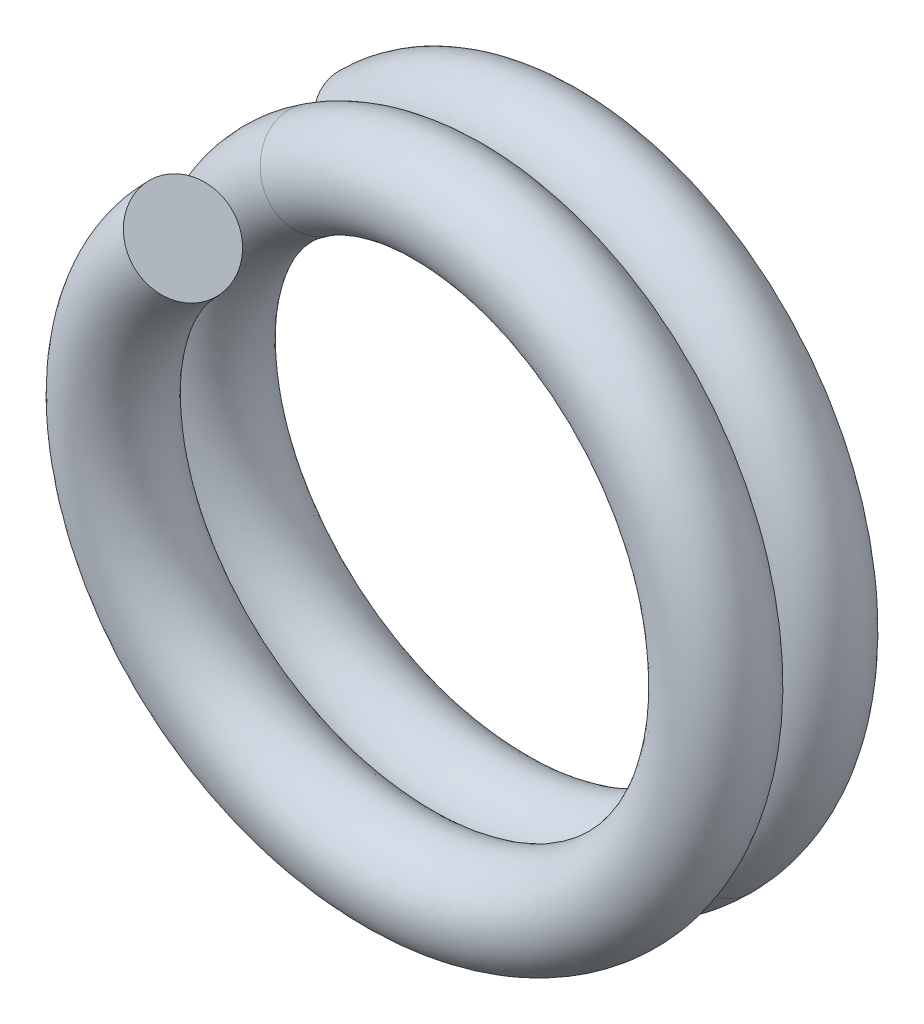
ISO-10303-21;
HEADER;
FILE_DESCRIPTION(('STEP AP214'),'2;1');
FILE_NAME('part.step','',(''),(''),'','','');
FILE_SCHEMA(('AUTOMOTIVE_DESIGN { 1 0 10303 214 1 1 1 1 }'));
ENDSEC;
DATA;
#1=APPLICATION_CONTEXT('core data for automotive mechanical design processes');
#2=APPLICATION_PROTOCOL_DEFINITION('international standard','automotive_design',2000,#1);
#3=PRODUCT_CONTEXT('',#1,'mechanical');
#4=PRODUCT('Part','Part','',(#3));
#5=PRODUCT_RELATED_PRODUCT_CATEGORY('part','',(#4));
#6=PRODUCT_DEFINITION_FORMATION('','',#4);
#7=PRODUCT_DEFINITION_CONTEXT('part definition',#1,'design');
#8=PRODUCT_DEFINITION('design','',#6,#7);
#9=PRODUCT_DEFINITION_SHAPE('','',#8);
#10=(LENGTH_UNIT() NAMED_UNIT(*) SI_UNIT(.MILLI.,.METRE.));
#11=(NAMED_UNIT(*) PLANE_ANGLE_UNIT() SI_UNIT($,.RADIAN.));
#12=(NAMED_UNIT(*) SI_UNIT($,.STERADIAN.) SOLID_ANGLE_UNIT());
#13=UNCERTAINTY_MEASURE_WITH_UNIT(LENGTH_MEASURE(1.E-05),#10,'distance_accuracy_value','');
#14=(GEOMETRIC_REPRESENTATION_CONTEXT(3) GLOBAL_UNCERTAINTY_ASSIGNED_CONTEXT((#13)) GLOBAL_UNIT_ASSIGNED_CONTEXT((#10,
#11,#12)) REPRESENTATION_CONTEXT('',''));
#15=CARTESIAN_POINT('',(0.,0.,0.));
#16=DIRECTION('',(0.,0.,1.));
#17=DIRECTION('',(1.,0.,0.));
#18=AXIS2_PLACEMENT_3D('',#15,#16,#17);
#19=CARTESIAN_POINT('',(7.2478445073792,-7.24784450694502,1.4999999999857));
#20=CARTESIAN_POINT('',(6.2991038813887,-8.19658513302185,1.56249999998574));
#21=CARTESIAN_POINT('',(5.1620945472785,-8.95631048126188,1.62499999998566));
#22=CARTESIAN_POINT('',(2.68291581648946,-9.98321993510202,1.75000000000004));
#23=CARTESIAN_POINT('',(1.3417218605146,-10.2499999999988,1.81250000000026));
#24=CARTESIAN_POINT('',(-1.34172186051466,-10.2500000000012,1.93749999999974));
#25=CARTESIAN_POINT('',(-2.68291581648708,-9.98321993510321,1.99999999999965));
#26=CARTESIAN_POINT('',(-5.16209454699733,-8.95631048137814,2.12500000000034));
#27=CARTESIAN_POINT('',(-6.29910388112856,-8.19658513319566,2.18749999999996));
#28=CARTESIAN_POINT('',(-8.19658513319572,-6.2991038811285,2.31250000000004));
#29=CARTESIAN_POINT('',(-8.9563104813806,-5.16209454699178,2.37499999999996));
#30=CARTESIAN_POINT('',(-9.98321993510082,-2.68291581649246,2.50000000000004));
#31=CARTESIAN_POINT('',(-10.2500000000024,-1.34172186051821,2.56249999999996));
#32=CARTESIAN_POINT('',(-10.2499999999976,1.34172186051833,2.68750000000004));
#33=CARTESIAN_POINT('',(-9.98321993509956,2.68291581649319,2.74999999999996));
#34=CARTESIAN_POINT('',(-8.95631048138176,5.16209454699129,2.87500000000004));
#35=CARTESIAN_POINT('',(-8.19658513320181,6.29910388112242,2.93750000000018));
#36=CARTESIAN_POINT('',(-6.77991612433642,7.7157728899878,3.03082562622893));
#37=CARTESIAN_POINT('',(-6.26619022540514,8.1377221490392,3.06165125245793));
#38=CARTESIAN_POINT('',(-5.7169474257057,8.50682299676349,3.09247687868696));
#39=CARTESIAN_POINT('',(7.36342751011872,-7.13226150419858,4.4955435464817));
#40=CARTESIAN_POINT('',(6.42981666378565,-8.09613190993147,4.55804354648189));
#41=CARTESIAN_POINT('',(5.30492284028362,-8.87398940116307,4.6205435464815));
#42=CARTESIAN_POINT('',(2.84212046498882,-9.94043487454094,4.74554354649619));
#43=CARTESIAN_POINT('',(1.50518091057382,-10.2286032604115,4.80804354649672));
#44=CARTESIAN_POINT('',(-1.17826281045603,-10.2713967395885,4.93304354649528));
#45=CARTESIAN_POINT('',(-2.52371116798757,-10.0260049956637,4.9955435464955));
#46=CARTESIAN_POINT('',(-5.01926625399049,-9.03863156147304,5.12054354649649));
#47=CARTESIAN_POINT('',(-6.16839109872854,-8.29703835628159,5.18304354649581));
#48=CARTESIAN_POINT('',(-8.09613191010979,-6.42981666352853,5.30804354649619));
#49=CARTESIAN_POINT('',(-8.87398940128571,-5.30492283999923,5.37054354649581));
#50=CARTESIAN_POINT('',(-9.94043487454035,-2.84212046499136,5.49554354649619));
#51=CARTESIAN_POINT('',(-10.2286032604158,-1.50518091057713,5.55804354649611));
#52=CARTESIAN_POINT('',(-10.2713967395842,1.17826281045941,5.68304354649589));
#53=CARTESIAN_POINT('',(-10.0260049956612,2.52371116799352,5.74554354649611));
#54=CARTESIAN_POINT('',(-9.03863156147545,5.0192662539846,5.87054354649589));
#55=CARTESIAN_POINT('',(-8.29703835628779,6.16839109872245,5.93304354649634));
#56=CARTESIAN_POINT('',(-6.90296128600154,7.60765204616697,6.02636917272486));
#57=CARTESIAN_POINT('',(-6.39596430658797,8.03779380740653,6.05719479895389));
#58=CARTESIAN_POINT('',(-5.85260764093189,8.41565355330545,6.08802042518296));
#59=CARTESIAN_POINT('',(5.24210716649553,-5.01094116070248,4.4955435464817));
#60=CARTESIAN_POINT('',(4.58617650337928,-5.69713138319389,4.55804354648189));
#61=CARTESIAN_POINT('',(3.79406589961683,-6.2526302359151,4.62054354648181));
#62=CARTESIAN_POINT('',(2.05687681138205,-7.01851684475557,4.74554354649589));
#63=CARTESIAN_POINT('',(1.11248182944733,-7.22860326041213,4.80804354649641));
#64=CARTESIAN_POINT('',(-0.785563729329528,-7.27139673958787,4.93304354649559));
#65=CARTESIAN_POINT('',(-1.73846751438155,-7.10408696587832,4.9955435464952));
#66=CARTESIAN_POINT('',(-3.50840931340595,-6.41727239619069,5.1205435464968));
#67=CARTESIAN_POINT('',(-4.32475093839831,-5.89803782949314,5.18304354649611));
#68=CARTESIAN_POINT('',(-5.69713138332072,-4.58617650319771,5.30804354649589));
#69=CARTESIAN_POINT('',(-6.25263023600456,-3.79406589941562,5.37054354649611));
#70=CARTESIAN_POINT('',(-7.01851684475376,-2.05687681138446,5.49554354649589));
#71=CARTESIAN_POINT('',(-7.22860326041365,-1.11248182944959,5.55804354649581));
#72=CARTESIAN_POINT('',(-7.27139673958635,0.785563729331826,5.68304354649619));
#73=CARTESIAN_POINT('',(-7.10408696587619,1.73846751438628,5.74554354649581));
#74=CARTESIAN_POINT('',(-6.4172723961928,3.50840931340127,5.87054354649619));
#75=CARTESIAN_POINT('',(-5.89803782949705,4.32475093839391,5.93304354649603));
#76=CARTESIAN_POINT('',(-4.9185955910738,5.34937705397544,6.02636917272501));
#77=CARTESIAN_POINT('',(-4.56195741134771,5.65602147110259,6.05719479895396));
#78=CARTESIAN_POINT('',(-4.17935473584772,5.9258517005945,6.08802042518296));
#79=CARTESIAN_POINT('',(5.12652416375602,-5.12652416344892,1.4999999999857));
#80=CARTESIAN_POINT('',(4.45546372098203,-5.79758460628397,1.56249999998574));
#81=CARTESIAN_POINT('',(3.65123760661186,-6.33495131601422,1.62499999998566));
#82=CARTESIAN_POINT('',(1.89767216288254,-7.06130190531634,1.75000000000004));
#83=CARTESIAN_POINT('',(0.949022779388409,-7.24999999999878,1.81250000000026));
#84=CARTESIAN_POINT('',(-0.949022779388453,-7.25000000000121,1.93749999999974));
#85=CARTESIAN_POINT('',(-1.89767216288106,-7.06130190531693,1.99999999999965));
#86=CARTESIAN_POINT('',(-3.65123760641279,-6.3349513160967,2.12500000000034));
#87=CARTESIAN_POINT('',(-4.45546372079803,-5.79758460640691,2.18749999999996));
#88=CARTESIAN_POINT('',(-5.79758460640695,-4.45546372079799,2.31250000000004));
#89=CARTESIAN_POINT('',(-6.33495131609915,-3.65123760640878,2.37499999999996));
#90=CARTESIAN_POINT('',(-7.06130190531453,-1.89767216288495,2.50000000000004));
#91=CARTESIAN_POINT('',(-7.25000000000061,-0.949022779390511,2.56249999999996));
#92=CARTESIAN_POINT('',(-7.24999999999939,0.949022779390599,2.68750000000004));
#93=CARTESIAN_POINT('',(-7.0613019053145,1.89767216288564,2.74999999999996));
#94=CARTESIAN_POINT('',(-6.33495131609912,3.65123760640826,2.87500000000004));
#95=CARTESIAN_POINT('',(-5.79758460641106,4.45546372079387,2.93750000000019));
#96=CARTESIAN_POINT('',(-4.79555042940867,5.45749789779627,3.03082562622893));
#97=CARTESIAN_POINT('',(-4.43218333016477,5.75594981273511,3.06165125245793));
#98=CARTESIAN_POINT('',(-4.04369452062137,6.01702114405231,3.09247687868696));
#99=CARTESIAN_POINT('',(5.0109411610165,-5.24210716619536,-1.4955435465103));
#100=CARTESIAN_POINT('',(4.32475093858478,-5.89803782937405,-1.43304354651041));
#101=CARTESIAN_POINT('',(3.50840931360689,-6.41727239611334,-1.37054354651049));
#102=CARTESIAN_POINT('',(1.73846751438303,-7.10408696587712,-1.24554354649581));
#103=CARTESIAN_POINT('',(0.785563729329485,-7.27139673958544,-1.18304354649589));
#104=CARTESIAN_POINT('',(-1.11248182944738,-7.22860326041456,-1.05804354649611));
#105=CARTESIAN_POINT('',(-2.05687681138058,-7.01851684475555,-0.995543546495889));
#106=CARTESIAN_POINT('',(-3.79406589941963,-6.25263023600271,-0.870543546496111));
#107=CARTESIAN_POINT('',(-4.58617650319775,-5.69713138332067,-0.808043546496193));
#108=CARTESIAN_POINT('',(-5.89803782949318,-4.32475093839826,-0.683043546495807));
#109=CARTESIAN_POINT('',(-6.41727239619375,-3.50840931340194,-0.620543546496193));
#110=CARTESIAN_POINT('',(-7.10408696587531,-1.73846751438543,-0.495543546495807));
#111=CARTESIAN_POINT('',(-7.27139673958756,-0.785563729331434,-0.43304354649589));
#112=CARTESIAN_POINT('',(-7.22860326041244,1.11248182944937,-0.30804354649611));
#113=CARTESIAN_POINT('',(-7.01851684475281,2.056876811385,-0.24554354649589));
#114=CARTESIAN_POINT('',(-6.25263023600543,3.79406589941526,-0.120543546496111));
#115=CARTESIAN_POINT('',(-5.69713138332508,4.58617650319384,-0.0580435464956631));
#116=CARTESIAN_POINT('',(-4.67250526774355,5.5656187416171,0.0352820797328591));
#117=CARTESIAN_POINT('',(-4.30240924898184,5.85587815436763,0.0661077059618862));
#118=CARTESIAN_POINT('',(-3.90803430539501,6.10819058751012,0.0969333321909604));
#119=CARTESIAN_POINT('',(7.13226150463969,-7.36342750969146,-1.4955435465103));
#120=CARTESIAN_POINT('',(6.16839109899175,-8.29703835611224,-1.43304354651041));
#121=CARTESIAN_POINT('',(5.01926625427338,-9.03863156136069,-1.37054354651019));
#122=CARTESIAN_POINT('',(2.52371116799009,-10.0260049956631,-1.24554354649611));
#123=CARTESIAN_POINT('',(1.17826281045537,-10.271396739586,-1.18304354649619));
#124=CARTESIAN_POINT('',(-1.50518091057328,-10.228603260414,-1.05804354649581));
#125=CARTESIAN_POINT('',(-2.8421204649866,-9.94043487454273,-0.995543546496193));
#126=CARTESIAN_POINT('',(-5.30492284000417,-8.87398940128324,-0.870543546495807));
#127=CARTESIAN_POINT('',(-6.42981666352859,-8.09613191010973,-0.808043546495889));
#128=CARTESIAN_POINT('',(-8.29703835628165,-6.16839109872848,-0.68304354649611));
#129=CARTESIAN_POINT('',(-9.0386315614755,-5.01926625398433,-0.62054354649589));
#130=CARTESIAN_POINT('',(-10.0260049956613,-2.52371116799355,-0.495543546496111));
#131=CARTESIAN_POINT('',(-10.2713967395891,-1.17826281045928,-0.433043546496193));
#132=CARTESIAN_POINT('',(-10.2286032604109,1.50518091057726,-0.308043546495807));
#133=CARTESIAN_POINT('',(-9.94043487453786,2.84212046499285,-0.245543546496193));
#134=CARTESIAN_POINT('',(-8.87398940128808,5.30492283999799,-0.120543546495807));
#135=CARTESIAN_POINT('',(-8.09613191011582,6.42981666352239,-0.0580435464959666));
#136=CARTESIAN_POINT('',(-6.6568709626713,7.82389373380863,0.0352820797330088));
#137=CARTESIAN_POINT('',(-6.13641614422231,8.23765049067186,0.0661077059619641));
#138=CARTESIAN_POINT('',(-5.58128721047952,8.59799244022152,0.0969333321909635));
#139=CARTESIAN_POINT('',(7.2478445073792,-7.24784450694502,1.4999999999857));
#140=CARTESIAN_POINT('',(6.2991038813887,-8.19658513302185,1.56249999998574));
#141=CARTESIAN_POINT('',(5.1620945472785,-8.95631048126188,1.62499999998566));
#142=CARTESIAN_POINT('',(2.68291581648946,-9.98321993510202,1.75000000000004));
#143=CARTESIAN_POINT('',(1.3417218605146,-10.2499999999988,1.81250000000026));
#144=CARTESIAN_POINT('',(-1.34172186051466,-10.2500000000012,1.93749999999974));
#145=CARTESIAN_POINT('',(-2.68291581648708,-9.98321993510321,1.99999999999965));
#146=CARTESIAN_POINT('',(-5.16209454699733,-8.95631048137814,2.12500000000034));
#147=CARTESIAN_POINT('',(-6.29910388112856,-8.19658513319566,2.18749999999996));
#148=CARTESIAN_POINT('',(-8.19658513319572,-6.2991038811285,2.31250000000004));
#149=CARTESIAN_POINT('',(-8.9563104813806,-5.16209454699178,2.37499999999996));
#150=CARTESIAN_POINT('',(-9.98321993510082,-2.68291581649246,2.50000000000004));
#151=CARTESIAN_POINT('',(-10.2500000000024,-1.34172186051821,2.56249999999996));
#152=CARTESIAN_POINT('',(-10.2499999999976,1.34172186051833,2.68750000000004));
#153=CARTESIAN_POINT('',(-9.98321993509956,2.68291581649319,2.74999999999996));
#154=CARTESIAN_POINT('',(-8.95631048138176,5.16209454699129,2.87500000000004));
#155=CARTESIAN_POINT('',(-8.19658513320181,6.29910388112242,2.93750000000018));
#156=CARTESIAN_POINT('',(-6.77991612433642,7.7157728899878,3.03082562622893));
#157=CARTESIAN_POINT('',(-6.26619022540514,8.1377221490392,3.06165125245793));
#158=CARTESIAN_POINT('',(-5.7169474257057,8.50682299676349,3.09247687868696));
#159=(BOUNDED_SURFACE() B_SPLINE_SURFACE(3,3,((#19,#20,#21,#22,#23,#24,#25,#26,#27,#28,#29,#30,
#31,#32,#33,#34,#35,#36,#37,#38),(#39,#40,#41,#42,#43,#44,#45,#46,#47,#48,#49,#50,#51,#52,#53,
#54,#55,#56,#57,#58),(#59,#60,#61,#62,#63,#64,#65,#66,#67,#68,#69,#70,#71,#72,#73,#74,#75,#76,
#77,#78),(#79,#80,#81,#82,#83,#84,#85,#86,#87,#88,#89,#90,#91,#92,#93,#94,#95,#96,#97,#98),(#99,
#100,#101,#102,#103,#104,#105,#106,#107,#108,#109,#110,#111,#112,#113,#114,#115,#116,#117,#118),
(#119,#120,#121,#122,#123,#124,#125,#126,#127,#128,#129,#130,#131,#132,#133,#134,#135,#136,#137,
#138),(#139,#140,#141,#142,#143,#144,#145,#146,#147,#148,#149,#150,#151,#152,#153,#154,#155,
#156,#157,#158)),.UNSPECIFIED.,.T.,.F.,.F.) B_SPLINE_SURFACE_WITH_KNOTS((4,3,4),(4,2,2,2,2,2,2,
2,2,4),(0.,0.5,1.),(0.25,0.28125,0.3125,0.34375,0.375,0.40625,0.4375,0.46875,0.5,
0.515412813114518),
.UNSPECIFIED.) GEOMETRIC_REPRESENTATION_ITEM() RATIONAL_B_SPLINE_SURFACE(((1.,1.,1.,1.,1.,1.,1.,
1.,1.,1.,1.,1.,1.,1.,1.,1.,1.,1.,1.,1.),(0.333333333333333,0.333333333333333,0.333333333333333,
0.333333333333333,0.333333333333333,0.333333333333333,0.333333333333333,0.333333333333333,
0.333333333333333,0.333333333333333,0.333333333333333,0.333333333333333,0.333333333333333,
0.333333333333333,0.333333333333333,0.333333333333333,0.333333333333333,0.333333333333333,
0.333333333333333,0.333333333333333),(0.333333333333333,0.333333333333333,0.333333333333333,
0.333333333333333,0.333333333333333,0.333333333333333,0.333333333333333,0.333333333333333,
0.333333333333333,0.333333333333333,0.333333333333333,0.333333333333333,0.333333333333333,
0.333333333333333,0.333333333333333,0.333333333333333,0.333333333333333,0.333333333333333,
0.333333333333333,0.333333333333333),(1.,1.,1.,1.,1.,1.,1.,1.,1.,1.,1.,1.,1.,1.,1.,1.,1.,1.,1.,
1.),(0.333333333333333,0.333333333333333,0.333333333333333,0.333333333333333,0.333333333333333,
0.333333333333333,0.333333333333333,0.333333333333333,0.333333333333333,0.333333333333333,
0.333333333333333,0.333333333333333,0.333333333333333,0.333333333333333,0.333333333333333,
0.333333333333333,0.333333333333333,0.333333333333333,0.333333333333333,0.333333333333333),
(0.333333333333333,0.333333333333333,0.333333333333333,0.333333333333333,0.333333333333333,
0.333333333333333,0.333333333333333,0.333333333333333,0.333333333333333,0.333333333333333,
0.333333333333333,0.333333333333333,0.333333333333333,0.333333333333333,0.333333333333333,
0.333333333333333,0.333333333333333,0.333333333333333,0.333333333333333,0.333333333333333),(1.,
1.,1.,1.,1.,1.,1.,1.,1.,1.,1.,1.,1.,1.,1.,1.,1.,1.,1.,1.))) REPRESENTATION_ITEM('') SURFACE());
#160=CARTESIAN_POINT('',(6.18718433612359,-6.18718433464099,1.49999999994279));
#161=DIRECTION('',(-0.706056384937713,-0.706056385106902,0.0544863500196415));
#162=DIRECTION('',(0.707106781271269,-0.707106781101827,0.));
#163=AXIS2_PLACEMENT_3D('',#160,#161,#162);
#164=CIRCLE('',#163,1.5);
#165=CARTESIAN_POINT('',(7.24784450803049,-7.24784450629373,1.49999999994279));
#166=VERTEX_POINT('',#165);
#167=EDGE_CURVE('E50',#166,#166,#164,.T.);
#168=CARTESIAN_POINT('',(-5.7169474257057,8.50682299676349,3.09247687868696));
#169=CARTESIAN_POINT('',(-5.85260764093189,8.41565355330545,6.08802042518296));
#170=CARTESIAN_POINT('',(-4.17935473584772,5.9258517005945,6.08802042518296));
#171=CARTESIAN_POINT('',(-4.04369452062137,6.01702114405231,3.09247687868696));
#172=CARTESIAN_POINT('',(-3.90803430539501,6.10819058751012,0.0969333321909604));
#173=CARTESIAN_POINT('',(-5.58128721047952,8.59799244022152,0.0969333321909635));
#174=CARTESIAN_POINT('',(-5.7169474257057,8.50682299676349,3.09247687868696));
#175=(BOUNDED_CURVE() B_SPLINE_CURVE(3,(#168,#169,#170,#171,#172,#173,#174),.UNSPECIFIED.,.T.,
.F.) B_SPLINE_CURVE_WITH_KNOTS((4,3,4),(0.,0.5,1.),
.UNSPECIFIED.) CURVE() GEOMETRIC_REPRESENTATION_ITEM() RATIONAL_B_SPLINE_CURVE((1.,
0.333333333333333,0.333333333333333,1.,0.333333333333333,0.333333333333333,1.)) REPRESENTATION_ITEM(''));
#176=CARTESIAN_POINT('',(-5.7169474257057,8.50682299676349,3.09247687868696));
#177=VERTEX_POINT('',#176);
#178=EDGE_CURVE('E12',#177,#177,#175,.T.);
#179=ORIENTED_EDGE('',*,*,#167,.T.);
#180=EDGE_LOOP('',(#179));
#181=FACE_BOUND('',#180,.T.);
#182=ORIENTED_EDGE('',*,*,#178,.F.);
#183=EDGE_LOOP('',(#182));
#184=FACE_BOUND('',#183,.T.);
#185=ADVANCED_FACE('F45',(#181,#184),#159,.T.);
#186=CARTESIAN_POINT('',(-7.24784450716215,7.24784450716207,0.));
#187=CARTESIAN_POINT('',(-6.29910387697723,8.19658513734942,0.0624999999999998));
#188=CARTESIAN_POINT('',(-5.16209454699401,8.95631048138068,0.124999999999992));
#189=CARTESIAN_POINT('',(-2.68291581649041,9.98321993510066,0.250000000000008));
#190=CARTESIAN_POINT('',(-1.34172186051466,10.2499999999988,0.312500000000034));
#191=CARTESIAN_POINT('',(1.34172186051459,10.2500000000012,0.437499999999965));
#192=CARTESIAN_POINT('',(2.68291581648945,9.98321993510202,0.500000000000034));
#193=CARTESIAN_POINT('',(5.16209454699484,8.95631048137938,0.624999999999965));
#194=CARTESIAN_POINT('',(6.29910388112609,8.19658513319813,0.687500000000034));
#195=CARTESIAN_POINT('',(8.1965851331981,6.29910388112612,0.812499999999965));
#196=CARTESIAN_POINT('',(8.95631048137936,5.16209454699427,0.875000000000034));
#197=CARTESIAN_POINT('',(9.98321993510201,2.68291581649009,0.999999999999965));
#198=CARTESIAN_POINT('',(10.25,1.34172186051402,1.06250000000011));
#199=CARTESIAN_POINT('',(10.25,-1.34172186051401,1.18749999999989));
#200=CARTESIAN_POINT('',(9.9832199351008,-2.68291581648948,1.24999999999981));
#201=CARTESIAN_POINT('',(8.95631048149807,-5.16209454671122,1.37499999998589));
#202=CARTESIAN_POINT('',(8.19658513336952,-6.29910388086836,1.43749999998566));
#203=CARTESIAN_POINT('',(7.2478445073792,-7.24784450694502,1.4999999999857));
#204=CARTESIAN_POINT('',(-7.36342750990513,7.1322615044191,2.995543546496));
#205=CARTESIAN_POINT('',(-6.42981665944401,8.09613191433024,3.058043546496));
#206=CARTESIAN_POINT('',(-5.30492284000071,8.873989401287,3.12054354649599));
#207=CARTESIAN_POINT('',(-2.84212046499008,9.94043487453897,3.24554354649601));
#208=CARTESIAN_POINT('',(-1.50518091057359,10.2286032604121,3.30804354649603));
#209=CARTESIAN_POINT('',(1.17826281045566,10.2713967395879,3.43304354649596));
#210=CARTESIAN_POINT('',(2.52371116798978,10.0260049956637,3.49554354649603));
#211=CARTESIAN_POINT('',(5.01926625398814,9.03863156147306,3.62054354649596));
#212=CARTESIAN_POINT('',(6.16839109872607,8.29703835628406,3.68304354649634));
#213=CARTESIAN_POINT('',(8.09613191011217,6.42981666352615,3.80804354649566));
#214=CARTESIAN_POINT('',(8.87398940128446,5.30492284000096,3.87054354649603));
#215=CARTESIAN_POINT('',(9.94043487454153,2.84212046498976,3.99554354649596));
#216=CARTESIAN_POINT('',(10.2286032604133,1.50518091057295,4.05804354649619));
#217=CARTESIAN_POINT('',(10.2713967395867,-1.17826281045509,4.18304354649581));
#218=CARTESIAN_POINT('',(10.0260049956619,-2.52371116798981,4.24554354649558));
#219=CARTESIAN_POINT('',(9.03863156158784,-5.01926625370265,4.37054354648212));
#220=CARTESIAN_POINT('',(8.29703835645161,-6.16839109846587,4.4330435464815));
#221=CARTESIAN_POINT('',(7.36342751011872,-7.13226150419858,4.4955435464817));
#222=CARTESIAN_POINT('',(-5.24210716634547,5.01094116085946,2.995543546496));
#223=CARTESIAN_POINT('',(-4.58617650032805,5.6971313863257,3.058043546496));
#224=CARTESIAN_POINT('',(-3.79406589941716,6.25263023600462,3.12054354649599));
#225=CARTESIAN_POINT('',(-2.05687681138306,7.01851684475364,3.24554354649601));
#226=CARTESIAN_POINT('',(-1.11248182944753,7.22860326041274,3.30804354649603));
#227=CARTESIAN_POINT('',(0.785563729329631,7.27139673958726,3.43304354649597));
#228=CARTESIAN_POINT('',(1.73846751438348,7.10408696587712,3.49554354649603));
#229=CARTESIAN_POINT('',(3.50840931340393,6.41727239619192,3.62054354649597));
#230=CARTESIAN_POINT('',(4.32475093839676,5.89803782949408,3.68304354649634));
#231=CARTESIAN_POINT('',(5.6971313833222,4.58617650319683,3.80804354649566));
#232=CARTESIAN_POINT('',(6.25263023600302,3.79406589941719,3.87054354649604));
#233=CARTESIAN_POINT('',(7.01851684475525,2.05687681138299,3.99554354649597));
#234=CARTESIAN_POINT('',(7.22860326041365,1.1124818294469,4.05804354649619));
#235=CARTESIAN_POINT('',(7.27139673958635,-0.785563729329047,4.18304354649581));
#236=CARTESIAN_POINT('',(7.10408696587772,-1.73846751438335,4.24554354649558));
#237=CARTESIAN_POINT('',(6.41727239626989,-3.5084093132016,4.37054354648212));
#238=CARTESIAN_POINT('',(5.89803782961167,-4.32475093821119,4.43304354648151));
#239=CARTESIAN_POINT('',(5.24210716649553,-5.01094116070248,4.4955435464817));
#240=CARTESIAN_POINT('',(-5.1265241636025,5.12652416360244,0.));
#241=CARTESIAN_POINT('',(-4.45546371786097,5.79758460934518,0.0625));
#242=CARTESIAN_POINT('',(-3.65123760641016,6.3349513160986,0.124999999999992));
#243=CARTESIAN_POINT('',(-1.8976721628837,7.06130190531503,0.250000000000008));
#244=CARTESIAN_POINT('',(-0.949022779388457,7.24999999999939,0.312500000000035));
#245=CARTESIAN_POINT('',(0.949022779388405,7.25000000000061,0.437499999999965));
#246=CARTESIAN_POINT('',(1.89767216288314,7.06130190531574,0.500000000000035));
#247=CARTESIAN_POINT('',(3.65123760641062,6.33495131609793,0.624999999999966));
#248=CARTESIAN_POINT('',(4.45546372079678,5.79758460640815,0.687500000000035));
#249=CARTESIAN_POINT('',(5.79758460640813,4.4554637207968,0.812499999999965));
#250=CARTESIAN_POINT('',(6.33495131609732,3.65123760641065,0.875000000000035));
#251=CARTESIAN_POINT('',(7.06130190531634,1.89767216288317,0.999999999999965));
#252=CARTESIAN_POINT('',(7.25,0.949022779388131,1.06250000000011));
#253=CARTESIAN_POINT('',(7.25,-0.949022779388124,1.18749999999989));
#254=CARTESIAN_POINT('',(7.06130190531634,-1.89767216288286,1.24999999999981));
#255=CARTESIAN_POINT('',(6.33495131618042,-3.65123760621031,1.37499999998589));
#256=CARTESIAN_POINT('',(5.79758460652989,-4.45546372061399,1.43749999998566));
#257=CARTESIAN_POINT('',(5.12652416375602,-5.12652416344892,1.4999999999857));
#258=CARTESIAN_POINT('',(-5.01094116085952,5.24210716634542,-2.995543546496));
#259=CARTESIAN_POINT('',(-4.32475093539389,5.89803783236466,-2.933043546496));
#260=CARTESIAN_POINT('',(-3.50840931340316,6.41727239619259,-2.87054354649601));
#261=CARTESIAN_POINT('',(-1.73846751438434,7.10408696587642,-2.74554354649599));
#262=CARTESIAN_POINT('',(-0.785563729329381,7.27139673958605,-2.68304354649597));
#263=CARTESIAN_POINT('',(1.11248182944718,7.22860326041395,-2.55804354649603));
#264=CARTESIAN_POINT('',(2.05687681138281,7.01851684475435,-2.49554354649597));
#265=CARTESIAN_POINT('',(3.79406589941731,6.25263023600395,-2.37054354649603));
#266=CARTESIAN_POINT('',(4.58617650319681,5.69713138332222,-2.30804354649627));
#267=CARTESIAN_POINT('',(5.89803782949406,4.32475093839678,-2.18304354649573));
#268=CARTESIAN_POINT('',(6.41727239619161,3.50840931340411,-2.12054354649597));
#269=CARTESIAN_POINT('',(7.10408696587742,1.73846751438335,-1.99554354649603));
#270=CARTESIAN_POINT('',(7.27139673958635,0.785563729329357,-1.93304354649597));
#271=CARTESIAN_POINT('',(7.22860326041365,-1.1124818294472,-1.80804354649603));
#272=CARTESIAN_POINT('',(7.01851684475495,-2.05687681138237,-1.74554354649597));
#273=CARTESIAN_POINT('',(6.25263023609096,-3.79406589921903,-1.62054354651034));
#274=CARTESIAN_POINT('',(5.69713138344811,-4.58617650301678,-1.55804354651019));
#275=CARTESIAN_POINT('',(5.0109411610165,-5.24210716619536,-1.4955435465103));
#276=CARTESIAN_POINT('',(-7.13226150441917,7.36342750990505,-2.995543546496));
#277=CARTESIAN_POINT('',(-6.16839109451046,8.2970383603686,-2.933043546496));
#278=CARTESIAN_POINT('',(-5.01926625398732,9.03863156147436,-2.87054354649601));
#279=CARTESIAN_POINT('',(-2.52371116799075,10.0260049956624,-2.74554354649599));
#280=CARTESIAN_POINT('',(-1.17826281045574,10.2713967395854,-2.68304354649597));
#281=CARTESIAN_POINT('',(1.50518091057351,10.2286032604146,-2.55804354649603));
#282=CARTESIAN_POINT('',(2.84212046498911,9.94043487454033,-2.49554354649597));
#283=CARTESIAN_POINT('',(5.30492284000153,8.87398940128569,-2.37054354649603));
#284=CARTESIAN_POINT('',(6.42981666352612,8.0961319101122,-2.30804354649627));
#285=CARTESIAN_POINT('',(8.29703835628403,6.16839109872609,-2.18304354649573));
#286=CARTESIAN_POINT('',(9.03863156147426,5.01926625398758,-2.12054354649597));
#287=CARTESIAN_POINT('',(10.0260049956625,2.52371116799043,-1.99554354649603));
#288=CARTESIAN_POINT('',(10.2713967395867,1.1782628104551,-1.93304354649597));
#289=CARTESIAN_POINT('',(10.2286032604133,-1.50518091057294,-1.80804354649603));
#290=CARTESIAN_POINT('',(9.94043487453972,-2.84212046498914,-1.74554354649597));
#291=CARTESIAN_POINT('',(8.8739894014083,-5.30492283971978,-1.62054354651034));
#292=CARTESIAN_POINT('',(8.09613191028744,-6.42981666327086,-1.55804354651019));
#293=CARTESIAN_POINT('',(7.13226150463969,-7.36342750969146,-1.4955435465103));
#294=CARTESIAN_POINT('',(-7.24784450716215,7.24784450716207,0.));
#295=CARTESIAN_POINT('',(-6.29910387697723,8.19658513734942,0.0624999999999998));
#296=CARTESIAN_POINT('',(-5.16209454699401,8.95631048138068,0.124999999999992));
#297=CARTESIAN_POINT('',(-2.68291581649041,9.98321993510066,0.250000000000008));
#298=CARTESIAN_POINT('',(-1.34172186051466,10.2499999999988,0.312500000000034));
#299=CARTESIAN_POINT('',(1.34172186051459,10.2500000000012,0.437499999999965));
#300=CARTESIAN_POINT('',(2.68291581648945,9.98321993510202,0.500000000000034));
#301=CARTESIAN_POINT('',(5.16209454699484,8.95631048137938,0.624999999999965));
#302=CARTESIAN_POINT('',(6.29910388112609,8.19658513319813,0.687500000000034));
#303=CARTESIAN_POINT('',(8.1965851331981,6.29910388112612,0.812499999999965));
#304=CARTESIAN_POINT('',(8.95631048137936,5.16209454699427,0.875000000000034));
#305=CARTESIAN_POINT('',(9.98321993510201,2.68291581649009,0.999999999999965));
#306=CARTESIAN_POINT('',(10.25,1.34172186051402,1.06250000000011));
#307=CARTESIAN_POINT('',(10.25,-1.34172186051401,1.18749999999989));
#308=CARTESIAN_POINT('',(9.9832199351008,-2.68291581648948,1.24999999999981));
#309=CARTESIAN_POINT('',(8.95631048149807,-5.16209454671122,1.37499999998589));
#310=CARTESIAN_POINT('',(8.19658513336952,-6.29910388086836,1.43749999998566));
#311=CARTESIAN_POINT('',(7.2478445073792,-7.24784450694502,1.4999999999857));
#312=(BOUNDED_SURFACE() B_SPLINE_SURFACE(3,3,((#186,#187,#188,#189,#190,#191,#192,#193,#194,
#195,#196,#197,#198,#199,#200,#201,#202,#203),(#204,#205,#206,#207,#208,#209,#210,#211,#212,
#213,#214,#215,#216,#217,#218,#219,#220,#221),(#222,#223,#224,#225,#226,#227,#228,#229,#230,
#231,#232,#233,#234,#235,#236,#237,#238,#239),(#240,#241,#242,#243,#244,#245,#246,#247,#248,
#249,#250,#251,#252,#253,#254,#255,#256,#257),(#258,#259,#260,#261,#262,#263,#264,#265,#266,
#267,#268,#269,#270,#271,#272,#273,#274,#275),(#276,#277,#278,#279,#280,#281,#282,#283,#284,
#285,#286,#287,#288,#289,#290,#291,#292,#293),(#294,#295,#296,#297,#298,#299,#300,#301,#302,
#303,#304,#305,#306,#307,#308,#309,#310,#311)),.UNSPECIFIED.,.T.,.F.,
.F.) B_SPLINE_SURFACE_WITH_KNOTS((4,3,4),(4,2,2,2,2,2,2,2,4),(0.,0.5,1.),(0.,0.03125,0.0625,
0.09375,0.125,0.15625,0.1875,0.21875,0.25),
.UNSPECIFIED.) GEOMETRIC_REPRESENTATION_ITEM() RATIONAL_B_SPLINE_SURFACE(((1.,1.,1.,1.,1.,1.,1.,
1.,1.,1.,1.,1.,1.,1.,1.,1.,1.,1.),(0.333333333333333,0.333333333333333,0.333333333333333,
0.333333333333333,0.333333333333333,0.333333333333333,0.333333333333333,0.333333333333333,
0.333333333333333,0.333333333333333,0.333333333333333,0.333333333333333,0.333333333333333,
0.333333333333333,0.333333333333333,0.333333333333333,0.333333333333333,0.333333333333333),
(0.333333333333333,0.333333333333333,0.333333333333333,0.333333333333333,0.333333333333333,
0.333333333333333,0.333333333333333,0.333333333333333,0.333333333333333,0.333333333333333,
0.333333333333333,0.333333333333333,0.333333333333333,0.333333333333333,0.333333333333333,
0.333333333333333,0.333333333333333,0.333333333333333),(1.,1.,1.,1.,1.,1.,1.,1.,1.,1.,1.,1.,1.,
1.,1.,1.,1.,1.),(0.333333333333333,0.333333333333333,0.333333333333333,0.333333333333333,
0.333333333333333,0.333333333333333,0.333333333333333,0.333333333333333,0.333333333333333,
0.333333333333333,0.333333333333333,0.333333333333333,0.333333333333333,0.333333333333333,
0.333333333333333,0.333333333333333,0.333333333333333,0.333333333333333),(0.333333333333333,
0.333333333333333,0.333333333333333,0.333333333333333,0.333333333333333,0.333333333333333,
0.333333333333333,0.333333333333333,0.333333333333333,0.333333333333333,0.333333333333333,
0.333333333333333,0.333333333333333,0.333333333333333,0.333333333333333,0.333333333333333,
0.333333333333333,0.333333333333333),(1.,1.,1.,1.,1.,1.,1.,1.,1.,1.,1.,1.,1.,1.,1.,1.,1.,1.))) REPRESENTATION_ITEM('') SURFACE());
#313=CARTESIAN_POINT('',(-6.18718433538232,6.18718433538226,0.));
#314=DIRECTION('',(0.706056385022303,0.706056385022311,0.0544863500196416));
#315=DIRECTION('',(-0.707106781186551,0.707106781186544,0.));
#316=AXIS2_PLACEMENT_3D('',#313,#314,#315);
#317=CIRCLE('',#316,1.5);
#318=CARTESIAN_POINT('',(-7.24784450716215,7.24784450716207,0.));
#319=VERTEX_POINT('',#318);
#320=EDGE_CURVE('E60',#319,#319,#317,.T.);
#321=ORIENTED_EDGE('',*,*,#320,.T.);
#322=EDGE_LOOP('',(#321));
#323=FACE_BOUND('',#322,.T.);
#324=ORIENTED_EDGE('',*,*,#167,.F.);
#325=EDGE_LOOP('',(#324));
#326=FACE_BOUND('',#325,.T.);
#327=ADVANCED_FACE('F79',(#323,#326),#312,.T.);
#328=CARTESIAN_POINT('',(-6.18718433538232,6.18718433538226,0.));
#329=DIRECTION('',(0.706056385022303,0.706056385022311,0.0544863500196416));
#330=DIRECTION('',(-0.707106781186551,0.707106781186544,0.));
#331=AXIS2_PLACEMENT_3D('',#328,#329,#330);
#332=PLANE('',#331);
#333=ORIENTED_EDGE('',*,*,#320,.F.);
#334=EDGE_LOOP('',(#333));
#335=FACE_BOUND('',#334,.T.);
#336=ADVANCED_FACE('F82',(#335),#332,.F.);
#337=CARTESIAN_POINT('',(-6.18718433538216,6.18718433538242,6.));
#338=DIRECTION('',(0.706056385022322,0.706056385022293,0.0544863500196416));
#339=DIRECTION('',(-0.707106781186533,0.707106781186562,0.));
#340=AXIS2_PLACEMENT_3D('',#337,#338,#339);
#341=PLANE('',#340);
#342=CARTESIAN_POINT('',(-6.18718433538216,6.18718433538242,6.));
#343=DIRECTION('',(0.706056385022322,0.706056385022293,0.0544863500196416));
#344=DIRECTION('',(-0.707106781186533,0.707106781186562,0.));
#345=AXIS2_PLACEMENT_3D('',#342,#343,#344);
#346=CIRCLE('',#345,1.5);
#347=CARTESIAN_POINT('',(-7.24784450716196,7.24784450716226,6.));
#348=VERTEX_POINT('',#347);
#349=EDGE_CURVE('E64',#348,#348,#346,.T.);
#350=ORIENTED_EDGE('',*,*,#349,.T.);
#351=EDGE_LOOP('',(#350));
#352=FACE_BOUND('',#351,.T.);
#353=ADVANCED_FACE('F65',(#352),#341,.T.);
#354=CARTESIAN_POINT('',(-5.7169474257057,8.50682299676349,3.09247687868696));
#355=CARTESIAN_POINT('',(-5.15258186831421,8.88608660435849,3.12415125245793));
#356=CARTESIAN_POINT('',(-4.55071665178184,9.20955149731224,3.15582562622894));
#357=CARTESIAN_POINT('',(-2.68291581649075,9.98321993510064,3.25000000000018));
#358=CARTESIAN_POINT('',(-1.34172186051423,10.25,3.31250000000012));
#359=CARTESIAN_POINT('',(1.34172186051443,10.25,3.43749999999988));
#360=CARTESIAN_POINT('',(2.68291581648971,9.98321993510057,3.50000000000012));
#361=CARTESIAN_POINT('',(5.16209454699482,8.95631048138073,3.62499999999988));
#362=CARTESIAN_POINT('',(6.29910388112659,8.19658513319764,3.68750000000012));
#363=CARTESIAN_POINT('',(8.1965851331978,6.29910388112642,3.81249999999988));
#364=CARTESIAN_POINT('',(8.95631048138203,5.16209454698793,3.87499999999951));
#365=CARTESIAN_POINT('',(9.98321993509945,2.68291581649617,4.00000000000049));
#366=CARTESIAN_POINT('',(10.25,1.34172186052027,4.06250000000012));
#367=CARTESIAN_POINT('',(10.25,-1.34172186052053,4.18749999999988));
#368=CARTESIAN_POINT('',(9.9832199351042,-2.68291581648368,4.25000000000012));
#369=CARTESIAN_POINT('',(8.95631048137707,-5.16209454700092,4.37499999999988));
#370=CARTESIAN_POINT('',(8.19658513320187,-6.29910388112236,4.43750000000012));
#371=CARTESIAN_POINT('',(6.29910388112216,-8.19658513320207,4.56249999999988));
#372=CARTESIAN_POINT('',(5.16209454698852,-8.95631048138325,4.62500000000073));
#373=CARTESIAN_POINT('',(2.68291581649555,-9.98321993509824,4.74999999999927));
#374=CARTESIAN_POINT('',(1.34172186050749,-10.2500000000012,4.81250000000073));
#375=CARTESIAN_POINT('',(-1.34172186050782,-10.2499999999988,4.93749999999927));
#376=CARTESIAN_POINT('',(-2.68291581648492,-9.98321993510418,4.99999999999951));
#377=CARTESIAN_POINT('',(-5.16209454699974,-8.95631048137706,5.12500000000049));
#378=CARTESIAN_POINT('',(-6.29910388112178,-8.19658513320245,5.18750000000012));
#379=CARTESIAN_POINT('',(-8.1965851332027,-6.29910388112152,5.31249999999988));
#380=CARTESIAN_POINT('',(-8.95631048138327,-5.16209454698849,5.37500000000012));
#381=CARTESIAN_POINT('',(-9.98321993509825,-2.68291581649552,5.49999999999988));
#382=CARTESIAN_POINT('',(-10.2500000000012,-1.34172186050745,5.56250000000012));
#383=CARTESIAN_POINT('',(-10.2499999999988,1.34172186050786,5.68749999999988));
#384=CARTESIAN_POINT('',(-9.98321993510417,2.68291581648496,5.75000000000012));
#385=CARTESIAN_POINT('',(-8.95631048137705,5.16209454699977,5.87499999999988));
#386=CARTESIAN_POINT('',(-8.19658513735541,6.29910387697124,5.93749999999891));
#387=CARTESIAN_POINT('',(-7.24784450716196,7.24784450716226,6.));
#388=CARTESIAN_POINT('',(-5.85260764093189,8.41565355330545,6.08802042518296));
#389=CARTESIAN_POINT('',(-5.2942902853959,8.80391722508549,6.11969479895397));
#390=CARTESIAN_POINT('',(-4.69758343609569,9.13698019770344,6.15136917272502));
#391=CARTESIAN_POINT('',(-2.84212046499081,9.94043487454002,6.24554354649603));
#392=CARTESIAN_POINT('',(-1.50518091057316,10.2286032604135,6.30804354649612));
#393=CARTESIAN_POINT('',(1.1782628104555,10.2713967395865,6.43304354649588));
#394=CARTESIAN_POINT('',(2.52371116798996,10.0260049956618,6.49554354649612));
#395=CARTESIAN_POINT('',(5.01926625398822,9.03863156147487,6.62054354649588));
#396=CARTESIAN_POINT('',(6.16839109872668,8.29703835628368,6.68304354649627));
#397=CARTESIAN_POINT('',(8.09613191011176,6.42981666352634,6.80804354649573));
#398=CARTESIAN_POINT('',(8.87398940128728,5.30492283999483,6.87054354649551));
#399=CARTESIAN_POINT('',(9.94043487453883,2.84212046499563,6.99554354649649));
#400=CARTESIAN_POINT('',(10.2286032604135,1.50518091057919,7.05804354649612));
#401=CARTESIAN_POINT('',(10.2713967395865,-1.17826281046161,7.18304354649588));
#402=CARTESIAN_POINT('',(10.0260049956654,-2.52371116798377,7.24554354649612));
#403=CARTESIAN_POINT('',(9.03863156147122,-5.01926625399447,7.37054354649588));
#404=CARTESIAN_POINT('',(8.29703835628791,-6.16839109872245,7.43304354649612));
#405=CARTESIAN_POINT('',(6.42981666352207,-8.09613191011603,7.55804354649588));
#406=CARTESIAN_POINT('',(5.30492283999527,-8.87398940128911,7.62054354649688));
#407=CARTESIAN_POINT('',(2.84212046499515,-9.94043487453701,7.74554354649512));
#408=CARTESIAN_POINT('',(1.50518091056641,-10.2286032604141,7.80804354649688));
#409=CARTESIAN_POINT('',(-1.1782628104489,-10.2713967395859,7.93304354649512));
#410=CARTESIAN_POINT('',(-2.52371116798517,-10.0260049956648,7.99554354649551));
#411=CARTESIAN_POINT('',(-5.01926625399314,-9.03863156147181,8.12054354649649));
#412=CARTESIAN_POINT('',(-6.16839109872156,-8.29703835628819,8.18304354649642));
#413=CARTESIAN_POINT('',(-8.09613191011696,-6.42981666352174,8.30804354649557));
#414=CARTESIAN_POINT('',(-8.87398940128852,-5.30492283999509,8.37054354649642));
#415=CARTESIAN_POINT('',(-9.94043487453763,-2.84212046499527,8.49554354649557));
#416=CARTESIAN_POINT('',(-10.2286032604153,-1.50518091056668,8.55804354649642));
#417=CARTESIAN_POINT('',(-10.2713967395847,1.17826281044924,8.68304354649557));
#418=CARTESIAN_POINT('',(-10.0260049956654,2.52371116798535,8.74554354649642));
#419=CARTESIAN_POINT('',(-9.03863156147119,5.01926625399302,8.87054354649557));
#420=CARTESIAN_POINT('',(-8.29703836037469,6.16839109450458,8.93304354649521));
#421=CARTESIAN_POINT('',(-7.36342750990494,7.13226150441929,8.995543546496));
#422=CARTESIAN_POINT('',(-4.17935473584772,5.9258517005945,6.08802042518296));
#423=CARTESIAN_POINT('',(-3.78621754345086,6.20311138966391,6.11969479895389));
#424=CARTESIAN_POINT('',(-3.3656663672821,6.44150171068564,6.15136917272487));
#425=CARTESIAN_POINT('',(-2.05687681138257,7.01851684475364,6.24554354649633));
#426=CARTESIAN_POINT('',(-1.11248182944673,7.22860326041381,6.30804354649612));
#427=CARTESIAN_POINT('',(0.785563729329022,7.27139673958619,6.43304354649588));
#428=CARTESIAN_POINT('',(1.73846751438334,7.10408696587665,6.49554354649612));
#429=CARTESIAN_POINT('',(3.50840931340424,6.41727239619232,6.62054354649588));
#430=CARTESIAN_POINT('',(4.32475093839709,5.89803782949398,6.68304354649658));
#431=CARTESIAN_POINT('',(5.69713138332201,4.5861765031968,6.80804354649542));
#432=CARTESIAN_POINT('',(6.25263023600531,3.79406589941274,6.87054354649552));
#433=CARTESIAN_POINT('',(7.01851684475304,2.05687681138725,6.99554354649649));
#434=CARTESIAN_POINT('',(7.22860326041381,1.11248182945126,7.05804354649612));
#435=CARTESIAN_POINT('',(7.27139673958619,-0.785563729333599,7.18304354649588));
#436=CARTESIAN_POINT('',(7.10408696587907,-1.73846751437987,7.24554354649612));
#437=CARTESIAN_POINT('',(6.41727239618989,-3.50840931340776,7.37054354649588));
#438=CARTESIAN_POINT('',(5.89803782949761,-4.32475093839346,7.43304354649612));
#439=CARTESIAN_POINT('',(4.58617650319314,-5.69713138332567,7.55804354649588));
#440=CARTESIAN_POINT('',(3.79406589941349,-6.25263023600623,7.62054354649718));
#441=CARTESIAN_POINT('',(2.05687681138648,-7.01851684475214,7.74554354649482));
#442=CARTESIAN_POINT('',(1.11248182944228,-7.22860326041381,7.80804354649688));
#443=CARTESIAN_POINT('',(-0.785563729324673,-7.27139673958619,7.93304354649512));
#444=CARTESIAN_POINT('',(-1.73846751438035,-7.10408696587785,7.99554354649551));
#445=CARTESIAN_POINT('',(-3.50840931340732,-6.41727239619109,8.12054354649649));
#446=CARTESIAN_POINT('',(-4.32475093839378,-5.89803782949668,8.18304354649582));
#447=CARTESIAN_POINT('',(-5.69713138332538,-4.58617650319404,8.30804354649618));
#448=CARTESIAN_POINT('',(-6.25263023600654,-3.79406589941301,8.37054354649582));
#449=CARTESIAN_POINT('',(-7.01851684475185,-2.05687681138691,8.49554354649618));
#450=CARTESIAN_POINT('',(-7.22860326041381,-1.11248182944195,8.55804354649582));
#451=CARTESIAN_POINT('',(-7.27139673958619,0.785563729324395,8.68304354649618));
#452=CARTESIAN_POINT('',(-7.10408696587845,1.73846751437992,8.74554354649582));
#453=CARTESIAN_POINT('',(-6.41727239619048,3.5084093134078,8.87054354649618));
#454=CARTESIAN_POINT('',(-5.8980378323688,4.32475093539058,8.93304354649703));
#455=CARTESIAN_POINT('',(-5.24210716634534,5.0109411608596,8.995543546496));
#456=CARTESIAN_POINT('',(-4.04369452062137,6.01702114405231,3.09247687868696));
#457=CARTESIAN_POINT('',(-3.64450912636895,6.28528076893661,3.12415125245793));
#458=CARTESIAN_POINT('',(-3.21879958296801,6.51407301029414,3.15582562622894));
#459=CARTESIAN_POINT('',(-1.89767216288297,7.06130190531487,3.25000000000018));
#460=CARTESIAN_POINT('',(-0.94902277938796,7.25,3.31250000000012));
#461=CARTESIAN_POINT('',(0.949022779388099,7.25,3.43749999999988));
#462=CARTESIAN_POINT('',(1.89767216288309,7.06130190531542,3.50000000000012));
#463=CARTESIAN_POINT('',(3.65123760641084,6.33495131609818,3.62499999999988));
#464=CARTESIAN_POINT('',(4.455463720797,5.79758460640794,3.68750000000012));
#465=CARTESIAN_POINT('',(5.79758460640805,4.45546372079689,3.81249999999988));
#466=CARTESIAN_POINT('',(6.33495131609945,3.65123760640614,3.87499999999951));
#467=CARTESIAN_POINT('',(7.06130190531427,1.89767216288749,4.00000000000049));
#468=CARTESIAN_POINT('',(7.25000000000061,0.949022779392487,4.06250000000012));
#469=CARTESIAN_POINT('',(7.24999999999939,-0.949022779392676,4.18749999999988));
#470=CARTESIAN_POINT('',(7.06130190531784,-1.89767216287947,4.25000000000012));
#471=CARTESIAN_POINT('',(6.33495131609574,-3.65123760641451,4.37499999999988));
#472=CARTESIAN_POINT('',(5.79758460641156,-4.45546372079337,4.43750000000012));
#473=CARTESIAN_POINT('',(4.45546372079323,-5.79758460641171,4.56249999999988));
#474=CARTESIAN_POINT('',(3.65123760640674,-6.33495131610067,4.62500000000073));
#475=CARTESIAN_POINT('',(1.89767216288687,-7.06130190531306,4.74999999999927));
#476=CARTESIAN_POINT('',(0.949022779383358,-7.25000000000061,4.81250000000073));
#477=CARTESIAN_POINT('',(-0.949022779383598,-7.24999999999939,4.93749999999927));
#478=CARTESIAN_POINT('',(-1.8976721628798,-7.06130190531662,4.99999999999951));
#479=CARTESIAN_POINT('',(-3.65123760641423,-6.33495131609695,5.12500000000049));
#480=CARTESIAN_POINT('',(-4.455463720794,-5.79758460641094,5.18750000000012));
#481=CARTESIAN_POINT('',(-5.79758460641112,-4.45546372079382,5.31249999999988));
#482=CARTESIAN_POINT('',(-6.33495131610008,-3.65123760640641,5.37500000000012));
#483=CARTESIAN_POINT('',(-7.06130190531368,-1.89767216288715,5.49999999999988));
#484=CARTESIAN_POINT('',(-7.25,-0.949022779383029,5.56250000000012));
#485=CARTESIAN_POINT('',(-7.25,0.94902277938332,5.68749999999988));
#486=CARTESIAN_POINT('',(-7.06130190531782,1.89767216287952,5.75000000000012));
#487=CARTESIAN_POINT('',(-6.33495131609572,3.65123760641455,5.87499999999988));
#488=CARTESIAN_POINT('',(-5.7975846093489,4.45546371785725,5.93749999999891));
#489=CARTESIAN_POINT('',(-5.12652416360236,5.12652416360258,6.));
#490=CARTESIAN_POINT('',(-3.90803430539501,6.10819058751012,0.0969333321909604));
#491=CARTESIAN_POINT('',(-3.50280070928704,6.36745014820931,0.128607705961965));
#492=CARTESIAN_POINT('',(-3.07193279865393,6.58664430990264,0.16028207973302));
#493=CARTESIAN_POINT('',(-1.73846751438337,7.10408696587609,0.25445645350403));
#494=CARTESIAN_POINT('',(-0.785563729329187,7.27139673958619,0.316956453504121));
#495=CARTESIAN_POINT('',(1.11248182944717,7.22860326041381,0.441956453503878));
#496=CARTESIAN_POINT('',(2.05687681138285,7.01851684475419,0.504456453504121));
#497=CARTESIAN_POINT('',(3.79406589941744,6.25263023600403,0.629456453503879));
#498=CARTESIAN_POINT('',(4.58617650319691,5.69713138332189,0.691956453503666));
#499=CARTESIAN_POINT('',(5.89803782949409,4.32475093839697,0.816956453504333));
#500=CARTESIAN_POINT('',(6.4172723961936,3.50840931339954,0.879456453503514));
#501=CARTESIAN_POINT('',(7.1040869658755,1.73846751438774,1.00445645350449));
#502=CARTESIAN_POINT('',(7.2713967395874,0.785563729333714,1.06695645350412));
#503=CARTESIAN_POINT('',(7.22860326041259,-1.11248182945175,1.19195645350388));
#504=CARTESIAN_POINT('',(7.01851684475661,-2.05687681137908,1.25445645350412));
#505=CARTESIAN_POINT('',(6.2526302360016,-3.79406589942126,1.37945645350388));
#506=CARTESIAN_POINT('',(5.69713138332552,-4.58617650319328,1.44195645350412));
#507=CARTESIAN_POINT('',(4.32475093839332,-5.89803782949775,1.56695645350388));
#508=CARTESIAN_POINT('',(3.50840931339998,-6.41727239619512,1.62945645350427));
#509=CARTESIAN_POINT('',(1.73846751438727,-7.10408696587399,1.75445645350373));
#510=CARTESIAN_POINT('',(0.785563729324433,-7.2713967395874,1.81695645350458));
#511=CARTESIAN_POINT('',(-1.11248182944252,-7.22860326041259,1.94195645350342));
#512=CARTESIAN_POINT('',(-2.05687681137925,-7.01851684475539,2.00445645350351));
#513=CARTESIAN_POINT('',(-3.79406589942113,-6.2526302360028,2.12945645350449));
#514=CARTESIAN_POINT('',(-4.58617650319421,-5.6971313833252,2.19195645350442));
#515=CARTESIAN_POINT('',(-5.89803782949685,-4.3247509383936,2.31695645350358));
#516=CARTESIAN_POINT('',(-6.41727239619361,-3.50840931339981,2.37945645350443));
#517=CARTESIAN_POINT('',(-7.10408696587551,-1.7384675143874,2.50445645350358));
#518=CARTESIAN_POINT('',(-7.27139673958619,-0.785563729324104,2.56695645350442));
#519=CARTESIAN_POINT('',(-7.22860326041381,1.11248182944224,2.69195645350357));
#520=CARTESIAN_POINT('',(-7.0185168447572,2.05687681137912,2.75445645350442));
#521=CARTESIAN_POINT('',(-6.25263023600097,3.79406589942131,2.87945645350357));
#522=CARTESIAN_POINT('',(-5.69713138632901,4.58617650032392,2.94195645350078));
#523=CARTESIAN_POINT('',(-5.01094116085938,5.24210716634555,3.004456453504));
#524=CARTESIAN_POINT('',(-5.58128721047952,8.59799244022152,0.0969333321909635));
#525=CARTESIAN_POINT('',(-5.01087345123253,8.96825598363149,0.128607705961892));
#526=CARTESIAN_POINT('',(-4.40384986746798,9.28212279692105,0.160282079732866));
#527=CARTESIAN_POINT('',(-2.52371116799069,10.0260049956613,0.254456453504334));
#528=CARTESIAN_POINT('',(-1.17826281045531,10.2713967395865,0.316956453504121));
#529=CARTESIAN_POINT('',(1.50518091057335,10.2286032604135,0.441956453503878));
#530=CARTESIAN_POINT('',(2.84212046498947,9.94043487453934,0.504456453504121));
#531=CARTESIAN_POINT('',(5.30492284000142,8.87398940128658,0.629456453503879));
#532=CARTESIAN_POINT('',(6.4298166635265,8.09613191011159,0.691956453503969));
#533=CARTESIAN_POINT('',(8.29703835628384,6.16839109872651,0.81695645350403));
#534=CARTESIAN_POINT('',(9.03863156147678,5.01926625398102,0.879456453503514));
#535=CARTESIAN_POINT('',(10.0260049956601,2.52371116799672,1.00445645350449));
#536=CARTESIAN_POINT('',(10.2713967395865,1.17826281046134,1.06695645350412));
#537=CARTESIAN_POINT('',(10.2286032604135,-1.50518091057946,1.19195645350388));
#538=CARTESIAN_POINT('',(9.94043487454297,-2.84212046498358,1.25445645350412));
#539=CARTESIAN_POINT('',(8.87398940128293,-5.30492284000737,1.37945645350388));
#540=CARTESIAN_POINT('',(8.09613191011582,-6.42981666352227,1.44195645350412));
#541=CARTESIAN_POINT('',(6.16839109872224,-8.29703835628811,1.56695645350388));
#542=CARTESIAN_POINT('',(5.01926625398176,-9.03863156147739,1.62945645350458));
#543=CARTESIAN_POINT('',(2.52371116799595,-10.0260049956595,1.75445645350342));
#544=CARTESIAN_POINT('',(1.17826281044856,-10.2713967395883,1.81695645350458));
#545=CARTESIAN_POINT('',(-1.50518091056675,-10.2286032604117,1.94195645350342));
#546=CARTESIAN_POINT('',(-2.84212046498468,-9.94043487454356,2.00445645350351));
#547=CARTESIAN_POINT('',(-5.30492284000634,-8.87398940128231,2.12945645350449));
#548=CARTESIAN_POINT('',(-6.42981666352199,-8.09613191011671,2.19195645350382));
#549=CARTESIAN_POINT('',(-8.29703835628843,-6.16839109872131,2.31695645350418));
#550=CARTESIAN_POINT('',(-9.03863156147801,-5.01926625398188,2.37945645350382));
#551=CARTESIAN_POINT('',(-10.0260049956589,-2.52371116799576,2.50445645350418));
#552=CARTESIAN_POINT('',(-10.2713967395871,-1.17826281044822,2.56695645350382));
#553=CARTESIAN_POINT('',(-10.2286032604129,1.50518091056648,2.69195645350418));
#554=CARTESIAN_POINT('',(-9.94043487454294,2.84212046498456,2.75445645350382));
#555=CARTESIAN_POINT('',(-8.8739894012829,5.30492284000652,2.87945645350418));
#556=CARTESIAN_POINT('',(-8.09613191433612,6.42981665943791,2.9419564535026));
#557=CARTESIAN_POINT('',(-7.13226150441898,7.36342750990524,3.004456453504));
#558=CARTESIAN_POINT('',(-5.7169474257057,8.50682299676349,3.09247687868696));
#559=CARTESIAN_POINT('',(-5.15258186831421,8.88608660435849,3.12415125245793));
#560=CARTESIAN_POINT('',(-4.55071665178184,9.20955149731224,3.15582562622894));
#561=CARTESIAN_POINT('',(-2.68291581649075,9.98321993510064,3.25000000000018));
#562=CARTESIAN_POINT('',(-1.34172186051423,10.25,3.31250000000012));
#563=CARTESIAN_POINT('',(1.34172186051443,10.25,3.43749999999988));
#564=CARTESIAN_POINT('',(2.68291581648971,9.98321993510057,3.50000000000012));
#565=CARTESIAN_POINT('',(5.16209454699482,8.95631048138073,3.62499999999988));
#566=CARTESIAN_POINT('',(6.29910388112659,8.19658513319764,3.68750000000012));
#567=CARTESIAN_POINT('',(8.1965851331978,6.29910388112642,3.81249999999988));
#568=CARTESIAN_POINT('',(8.95631048138203,5.16209454698793,3.87499999999951));
#569=CARTESIAN_POINT('',(9.98321993509945,2.68291581649617,4.00000000000049));
#570=CARTESIAN_POINT('',(10.25,1.34172186052027,4.06250000000012));
#571=CARTESIAN_POINT('',(10.25,-1.34172186052053,4.18749999999988));
#572=CARTESIAN_POINT('',(9.9832199351042,-2.68291581648368,4.25000000000012));
#573=CARTESIAN_POINT('',(8.95631048137707,-5.16209454700092,4.37499999999988));
#574=CARTESIAN_POINT('',(8.19658513320187,-6.29910388112236,4.43750000000012));
#575=CARTESIAN_POINT('',(6.29910388112216,-8.19658513320207,4.56249999999988));
#576=CARTESIAN_POINT('',(5.16209454698852,-8.95631048138325,4.62500000000073));
#577=CARTESIAN_POINT('',(2.68291581649555,-9.98321993509824,4.74999999999927));
#578=CARTESIAN_POINT('',(1.34172186050749,-10.2500000000012,4.81250000000073));
#579=CARTESIAN_POINT('',(-1.34172186050782,-10.2499999999988,4.93749999999927));
#580=CARTESIAN_POINT('',(-2.68291581648492,-9.98321993510418,4.99999999999951));
#581=CARTESIAN_POINT('',(-5.16209454699974,-8.95631048137706,5.12500000000049));
#582=CARTESIAN_POINT('',(-6.29910388112178,-8.19658513320245,5.18750000000012));
#583=CARTESIAN_POINT('',(-8.1965851332027,-6.29910388112152,5.31249999999988));
#584=CARTESIAN_POINT('',(-8.95631048138327,-5.16209454698849,5.37500000000012));
#585=CARTESIAN_POINT('',(-9.98321993509825,-2.68291581649552,5.49999999999988));
#586=CARTESIAN_POINT('',(-10.2500000000012,-1.34172186050745,5.56250000000012));
#587=CARTESIAN_POINT('',(-10.2499999999988,1.34172186050786,5.68749999999988));
#588=CARTESIAN_POINT('',(-9.98321993510417,2.68291581648496,5.75000000000012));
#589=CARTESIAN_POINT('',(-8.95631048137705,5.16209454699977,5.87499999999988));
#590=CARTESIAN_POINT('',(-8.19658513735541,6.29910387697124,5.93749999999891));
#591=CARTESIAN_POINT('',(-7.24784450716196,7.24784450716226,6.));
#592=(BOUNDED_SURFACE() B_SPLINE_SURFACE(3,3,((#354,#355,#356,#357,#358,#359,#360,#361,#362,
#363,#364,#365,#366,#367,#368,#369,#370,#371,#372,#373,#374,#375,#376,#377,#378,#379,#380,#381,
#382,#383,#384,#385,#386,#387),(#388,#389,#390,#391,#392,#393,#394,#395,#396,#397,#398,#399,
#400,#401,#402,#403,#404,#405,#406,#407,#408,#409,#410,#411,#412,#413,#414,#415,#416,#417,#418,
#419,#420,#421),(#422,#423,#424,#425,#426,#427,#428,#429,#430,#431,#432,#433,#434,#435,#436,
#437,#438,#439,#440,#441,#442,#443,#444,#445,#446,#447,#448,#449,#450,#451,#452,#453,#454,#455),
(#456,#457,#458,#459,#460,#461,#462,#463,#464,#465,#466,#467,#468,#469,#470,#471,#472,#473,#474,
#475,#476,#477,#478,#479,#480,#481,#482,#483,#484,#485,#486,#487,#488,#489),(#490,#491,#492,
#493,#494,#495,#496,#497,#498,#499,#500,#501,#502,#503,#504,#505,#506,#507,#508,#509,#510,#511,
#512,#513,#514,#515,#516,#517,#518,#519,#520,#521,#522,#523),(#524,#525,#526,#527,#528,#529,
#530,#531,#532,#533,#534,#535,#536,#537,#538,#539,#540,#541,#542,#543,#544,#545,#546,#547,#548,
#549,#550,#551,#552,#553,#554,#555,#556,#557),(#558,#559,#560,#561,#562,#563,#564,#565,#566,
#567,#568,#569,#570,#571,#572,#573,#574,#575,#576,#577,#578,#579,#580,#581,#582,#583,#584,#585,
#586,#587,#588,#589,#590,#591)),.UNSPECIFIED.,.T.,.F.,.F.) B_SPLINE_SURFACE_WITH_KNOTS((4,3,4),
(4,2,2,2,2,2,2,2,2,2,2,2,2,2,2,2,4),(0.,0.5,1.),(0.515412813114518,0.53125,0.5625,0.59375,0.625,
0.65625,0.6875,0.71875,0.75,0.78125,0.8125,0.84375,0.875,0.90625,0.9375,0.96875,1.),
.UNSPECIFIED.) GEOMETRIC_REPRESENTATION_ITEM() RATIONAL_B_SPLINE_SURFACE(((1.,1.,1.,1.,1.,1.,1.,
1.,1.,1.,1.,1.,1.,1.,1.,1.,1.,1.,1.,1.,1.,1.,1.,1.,1.,1.,1.,1.,1.,1.,1.,1.,1.,1.),
(0.333333333333333,0.333333333333333,0.333333333333333,0.333333333333333,0.333333333333333,
0.333333333333333,0.333333333333333,0.333333333333333,0.333333333333333,0.333333333333333,
0.333333333333333,0.333333333333333,0.333333333333333,0.333333333333333,0.333333333333333,
0.333333333333333,0.333333333333333,0.333333333333333,0.333333333333333,0.333333333333333,
0.333333333333333,0.333333333333333,0.333333333333333,0.333333333333333,0.333333333333333,
0.333333333333333,0.333333333333333,0.333333333333333,0.333333333333333,0.333333333333333,
0.333333333333333,0.333333333333333,0.333333333333333,0.333333333333333),(0.333333333333333,
0.333333333333333,0.333333333333333,0.333333333333333,0.333333333333333,0.333333333333333,
0.333333333333333,0.333333333333333,0.333333333333333,0.333333333333333,0.333333333333333,
0.333333333333333,0.333333333333333,0.333333333333333,0.333333333333333,0.333333333333333,
0.333333333333333,0.333333333333333,0.333333333333333,0.333333333333333,0.333333333333333,
0.333333333333333,0.333333333333333,0.333333333333333,0.333333333333333,0.333333333333333,
0.333333333333333,0.333333333333333,0.333333333333333,0.333333333333333,0.333333333333333,
0.333333333333333,0.333333333333333,0.333333333333333),(1.,1.,1.,1.,1.,1.,1.,1.,1.,1.,1.,1.,1.,
1.,1.,1.,1.,1.,1.,1.,1.,1.,1.,1.,1.,1.,1.,1.,1.,1.,1.,1.,1.,1.),(0.333333333333333,
0.333333333333333,0.333333333333333,0.333333333333333,0.333333333333333,0.333333333333333,
0.333333333333333,0.333333333333333,0.333333333333333,0.333333333333333,0.333333333333333,
0.333333333333333,0.333333333333333,0.333333333333333,0.333333333333333,0.333333333333333,
0.333333333333333,0.333333333333333,0.333333333333333,0.333333333333333,0.333333333333333,
0.333333333333333,0.333333333333333,0.333333333333333,0.333333333333333,0.333333333333333,
0.333333333333333,0.333333333333333,0.333333333333333,0.333333333333333,0.333333333333333,
0.333333333333333,0.333333333333333,0.333333333333333),(0.333333333333333,0.333333333333333,
0.333333333333333,0.333333333333333,0.333333333333333,0.333333333333333,0.333333333333333,
0.333333333333333,0.333333333333333,0.333333333333333,0.333333333333333,0.333333333333333,
0.333333333333333,0.333333333333333,0.333333333333333,0.333333333333333,0.333333333333333,
0.333333333333333,0.333333333333333,0.333333333333333,0.333333333333333,0.333333333333333,
0.333333333333333,0.333333333333333,0.333333333333333,0.333333333333333,0.333333333333333,
0.333333333333333,0.333333333333333,0.333333333333333,0.333333333333333,0.333333333333333,
0.333333333333333,0.333333333333333),(1.,1.,1.,1.,1.,1.,1.,1.,1.,1.,1.,1.,1.,1.,1.,1.,1.,1.,1.,
1.,1.,1.,1.,1.,1.,1.,1.,1.,1.,1.,1.,1.,1.,1.))) REPRESENTATION_ITEM('') SURFACE());
#593=ORIENTED_EDGE('',*,*,#178,.T.);
#594=EDGE_LOOP('',(#593));
#595=FACE_BOUND('',#594,.T.);
#596=ORIENTED_EDGE('',*,*,#349,.F.);
#597=EDGE_LOOP('',(#596));
#598=FACE_BOUND('',#597,.T.);
#599=ADVANCED_FACE('F84',(#595,#598),#592,.T.);
#600=CLOSED_SHELL('',(#185,#327,#336,#353,#599));
#601=MANIFOLD_SOLID_BREP('B2',#600);
#602=ADVANCED_BREP_SHAPE_REPRESENTATION('',(#18,#601),#14);
#603=SHAPE_DEFINITION_REPRESENTATION(#9,#602);
ENDSEC;
END-ISO-10303-21;
